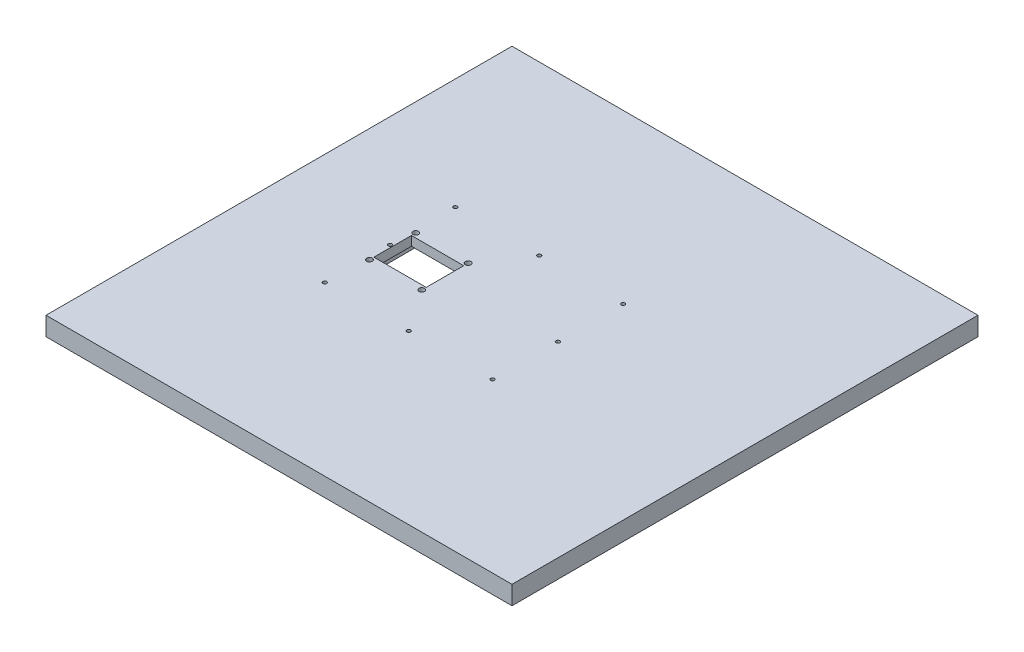
ISO-10303-21;
HEADER;
FILE_DESCRIPTION(('STEP AP214'),'2;1');
FILE_NAME('part.step','',(''),(''),'','','');
FILE_SCHEMA(('AUTOMOTIVE_DESIGN { 1 0 10303 214 1 1 1 1 }'));
ENDSEC;
DATA;
#1=APPLICATION_CONTEXT('core data for automotive mechanical design processes');
#2=APPLICATION_PROTOCOL_DEFINITION('international standard','automotive_design',2000,#1);
#3=PRODUCT_CONTEXT('',#1,'mechanical');
#4=PRODUCT('Part','Part','',(#3));
#5=PRODUCT_RELATED_PRODUCT_CATEGORY('part','',(#4));
#6=PRODUCT_DEFINITION_FORMATION('','',#4);
#7=PRODUCT_DEFINITION_CONTEXT('part definition',#1,'design');
#8=PRODUCT_DEFINITION('design','',#6,#7);
#9=PRODUCT_DEFINITION_SHAPE('','',#8);
#10=(LENGTH_UNIT() NAMED_UNIT(*) SI_UNIT(.MILLI.,.METRE.));
#11=(NAMED_UNIT(*) PLANE_ANGLE_UNIT() SI_UNIT($,.RADIAN.));
#12=(NAMED_UNIT(*) SI_UNIT($,.STERADIAN.) SOLID_ANGLE_UNIT());
#13=UNCERTAINTY_MEASURE_WITH_UNIT(LENGTH_MEASURE(1.E-05),#10,'distance_accuracy_value','');
#14=(GEOMETRIC_REPRESENTATION_CONTEXT(3) GLOBAL_UNCERTAINTY_ASSIGNED_CONTEXT((#13)) GLOBAL_UNIT_ASSIGNED_CONTEXT((#10,
#11,#12)) REPRESENTATION_CONTEXT('',''));
#15=CARTESIAN_POINT('',(0.,0.,0.));
#16=DIRECTION('',(0.,0.,1.));
#17=DIRECTION('',(1.,0.,0.));
#18=AXIS2_PLACEMENT_3D('',#15,#16,#17);
#19=CARTESIAN_POINT('',(-128.072056756494,20.,-24.8638216986086));
#20=DIRECTION('',(0.,-1.,0.));
#21=DIRECTION('',(0.,0.,-1.));
#22=AXIS2_PLACEMENT_3D('',#19,#20,#21);
#23=CYLINDRICAL_SURFACE('',#22,2.99999999999999);
#24=CARTESIAN_POINT('',(-128.072056756494,20.,-24.8638216986086));
#25=DIRECTION('',(0.,1.,0.));
#26=DIRECTION('',(0.,0.,1.));
#27=AXIS2_PLACEMENT_3D('',#24,#25,#26);
#28=CIRCLE('',#27,2.99999999999999);
#29=CARTESIAN_POINT('',(-128.072056756494,20.,-21.8638216986087));
#30=VERTEX_POINT('',#29);
#31=EDGE_CURVE('E216',#30,#30,#28,.T.);
#32=ORIENTED_EDGE('',*,*,#31,.T.);
#33=EDGE_LOOP('',(#32));
#34=FACE_BOUND('',#33,.T.);
#35=CARTESIAN_POINT('',(-128.072056756494,10.,-24.8638216986086));
#36=DIRECTION('',(0.,-1.,0.));
#37=DIRECTION('',(0.,0.,-1.));
#38=AXIS2_PLACEMENT_3D('',#35,#36,#37);
#39=CIRCLE('',#38,2.99999999999999);
#40=CARTESIAN_POINT('',(-128.072056756494,10.,-27.8638216986086));
#41=VERTEX_POINT('',#40);
#42=EDGE_CURVE('E184',#41,#41,#39,.T.);
#43=ORIENTED_EDGE('',*,*,#42,.T.);
#44=EDGE_LOOP('',(#43));
#45=FACE_BOUND('',#44,.T.);
#46=ADVANCED_FACE('F38',(#34,#45),#23,.F.);
#47=CARTESIAN_POINT('',(-71.9279432435065,20.,-24.8638216986087));
#48=DIRECTION('',(0.,-1.,0.));
#49=DIRECTION('',(0.,0.,-1.));
#50=AXIS2_PLACEMENT_3D('',#47,#48,#49);
#51=CYLINDRICAL_SURFACE('',#50,3.00000000000001);
#52=CARTESIAN_POINT('',(-71.9279432435065,20.,-24.8638216986087));
#53=DIRECTION('',(0.,1.,0.));
#54=DIRECTION('',(0.,0.,1.));
#55=AXIS2_PLACEMENT_3D('',#52,#53,#54);
#56=CIRCLE('',#55,3.00000000000001);
#57=CARTESIAN_POINT('',(-71.9279432435065,20.,-21.8638216986087));
#58=VERTEX_POINT('',#57);
#59=EDGE_CURVE('E213',#58,#58,#56,.T.);
#60=ORIENTED_EDGE('',*,*,#59,.T.);
#61=EDGE_LOOP('',(#60));
#62=FACE_BOUND('',#61,.T.);
#63=CARTESIAN_POINT('',(-71.9279432435065,10.,-24.8638216986087));
#64=DIRECTION('',(0.,-1.,0.));
#65=DIRECTION('',(0.,0.,-1.));
#66=AXIS2_PLACEMENT_3D('',#63,#64,#65);
#67=CIRCLE('',#66,3.00000000000001);
#68=CARTESIAN_POINT('',(-71.9279432435065,10.,-27.8638216986087));
#69=VERTEX_POINT('',#68);
#70=EDGE_CURVE('E181',#69,#69,#67,.T.);
#71=ORIENTED_EDGE('',*,*,#70,.T.);
#72=EDGE_LOOP('',(#71));
#73=FACE_BOUND('',#72,.T.);
#74=ADVANCED_FACE('F300',(#62,#73),#51,.F.);
#75=CARTESIAN_POINT('',(-71.9279432435065,20.,24.8638216986087));
#76=DIRECTION('',(0.,-1.,0.));
#77=DIRECTION('',(0.,0.,-1.));
#78=AXIS2_PLACEMENT_3D('',#75,#76,#77);
#79=CYLINDRICAL_SURFACE('',#78,3.00000000000001);
#80=CARTESIAN_POINT('',(-71.9279432435065,20.,24.8638216986087));
#81=DIRECTION('',(0.,1.,0.));
#82=DIRECTION('',(0.,0.,-1.));
#83=AXIS2_PLACEMENT_3D('',#80,#81,#82);
#84=CIRCLE('',#83,3.00000000000001);
#85=CARTESIAN_POINT('',(-71.9279432435065,20.,21.8638216986087));
#86=VERTEX_POINT('',#85);
#87=EDGE_CURVE('E210',#86,#86,#84,.T.);
#88=ORIENTED_EDGE('',*,*,#87,.T.);
#89=EDGE_LOOP('',(#88));
#90=FACE_BOUND('',#89,.T.);
#91=CARTESIAN_POINT('',(-71.9279432435065,10.,24.8638216986087));
#92=DIRECTION('',(0.,-1.,0.));
#93=DIRECTION('',(0.,0.,-1.));
#94=AXIS2_PLACEMENT_3D('',#91,#92,#93);
#95=CIRCLE('',#94,3.00000000000001);
#96=CARTESIAN_POINT('',(-71.9279432435065,10.,21.8638216986087));
#97=VERTEX_POINT('',#96);
#98=EDGE_CURVE('E178',#97,#97,#95,.T.);
#99=ORIENTED_EDGE('',*,*,#98,.T.);
#100=EDGE_LOOP('',(#99));
#101=FACE_BOUND('',#100,.T.);
#102=ADVANCED_FACE('F281',(#90,#101),#79,.F.);
#103=CARTESIAN_POINT('',(-128.072056756494,20.,24.8638216986086));
#104=DIRECTION('',(0.,-1.,0.));
#105=DIRECTION('',(0.,0.,-1.));
#106=AXIS2_PLACEMENT_3D('',#103,#104,#105);
#107=CYLINDRICAL_SURFACE('',#106,2.99999999999999);
#108=CARTESIAN_POINT('',(-128.072056756494,20.,24.8638216986086));
#109=DIRECTION('',(0.,1.,0.));
#110=DIRECTION('',(0.,0.,-1.));
#111=AXIS2_PLACEMENT_3D('',#108,#109,#110);
#112=CIRCLE('',#111,2.99999999999999);
#113=CARTESIAN_POINT('',(-128.072056756494,20.,21.8638216986087));
#114=VERTEX_POINT('',#113);
#115=EDGE_CURVE('E202',#114,#114,#112,.T.);
#116=ORIENTED_EDGE('',*,*,#115,.T.);
#117=EDGE_LOOP('',(#116));
#118=FACE_BOUND('',#117,.T.);
#119=CARTESIAN_POINT('',(-128.072056756494,10.,24.8638216986086));
#120=DIRECTION('',(0.,-1.,0.));
#121=DIRECTION('',(0.,0.,-1.));
#122=AXIS2_PLACEMENT_3D('',#119,#120,#121);
#123=CIRCLE('',#122,2.99999999999999);
#124=CARTESIAN_POINT('',(-128.072056756494,10.,21.8638216986087));
#125=VERTEX_POINT('',#124);
#126=EDGE_CURVE('E175',#125,#125,#123,.T.);
#127=ORIENTED_EDGE('',*,*,#126,.T.);
#128=EDGE_LOOP('',(#127));
#129=FACE_BOUND('',#128,.T.);
#130=ADVANCED_FACE('F277',(#118,#129),#107,.F.);
#131=CARTESIAN_POINT('',(-128.072056756494,0.,0.));
#132=DIRECTION('',(-1.,0.,0.));
#133=DIRECTION('',(0.,0.,1.));
#134=AXIS2_PLACEMENT_3D('',#131,#132,#133);
#135=PLANE('',#134);
#136=DIRECTION('',(0.,0.,1.));
#137=VECTOR('',#136,1.);
#138=CARTESIAN_POINT('',(-128.072056756494,10.,0.));
#139=LINE('',#138,#137);
#140=CARTESIAN_POINT('',(-128.072056756494,10.,-20.1442639638611));
#141=VERTEX_POINT('',#140);
#142=CARTESIAN_POINT('',(-128.072056756494,10.,20.1442639638611));
#143=VERTEX_POINT('',#142);
#144=EDGE_CURVE('E61',#141,#143,#139,.T.);
#145=ORIENTED_EDGE('',*,*,#144,.F.);
#146=DIRECTION('',(0.,1.,0.));
#147=VECTOR('',#146,1.);
#148=CARTESIAN_POINT('',(-128.072056756494,0.,-20.1442639638611));
#149=LINE('',#148,#147);
#150=CARTESIAN_POINT('',(-128.072056756494,20.,-20.1442639638611));
#151=VERTEX_POINT('',#150);
#152=EDGE_CURVE('E200',#141,#151,#149,.T.);
#153=ORIENTED_EDGE('',*,*,#152,.T.);
#154=DIRECTION('',(0.,0.,1.));
#155=VECTOR('',#154,1.);
#156=CARTESIAN_POINT('',(-128.072056756494,20.,0.));
#157=LINE('',#156,#155);
#158=CARTESIAN_POINT('',(-128.072056756494,20.,20.1442639638611));
#159=VERTEX_POINT('',#158);
#160=EDGE_CURVE('E187',#151,#159,#157,.T.);
#161=ORIENTED_EDGE('',*,*,#160,.T.);
#162=DIRECTION('',(0.,1.,0.));
#163=VECTOR('',#162,1.);
#164=CARTESIAN_POINT('',(-128.072056756494,0.,20.1442639638611));
#165=LINE('',#164,#163);
#166=EDGE_CURVE('E199',#143,#159,#165,.T.);
#167=ORIENTED_EDGE('',*,*,#166,.F.);
#168=EDGE_LOOP('',(#145,#153,#161,#167));
#169=FACE_BOUND('',#168,.T.);
#170=ADVANCED_FACE('F280',(#169),#135,.F.);
#171=CARTESIAN_POINT('',(0.,0.,-20.1442639638611));
#172=DIRECTION('',(0.,0.,1.));
#173=DIRECTION('',(1.,0.,0.));
#174=AXIS2_PLACEMENT_3D('',#171,#172,#173);
#175=PLANE('',#174);
#176=ORIENTED_EDGE('',*,*,#152,.F.);
#177=DIRECTION('',(1.,0.,0.));
#178=VECTOR('',#177,1.);
#179=CARTESIAN_POINT('',(0.,10.,-20.1442639638611));
#180=LINE('',#179,#178);
#181=CARTESIAN_POINT('',(-71.9279432435065,10.,-20.1442639638611));
#182=VERTEX_POINT('',#181);
#183=EDGE_CURVE('E171',#141,#182,#180,.T.);
#184=ORIENTED_EDGE('',*,*,#183,.T.);
#185=DIRECTION('',(0.,1.,0.));
#186=VECTOR('',#185,1.);
#187=CARTESIAN_POINT('',(-71.9279432435065,0.,-20.1442639638611));
#188=LINE('',#187,#186);
#189=CARTESIAN_POINT('',(-71.9279432435065,20.,-20.1442639638611));
#190=VERTEX_POINT('',#189);
#191=EDGE_CURVE('E203',#182,#190,#188,.T.);
#192=ORIENTED_EDGE('',*,*,#191,.T.);
#193=DIRECTION('',(1.,0.,0.));
#194=VECTOR('',#193,1.);
#195=CARTESIAN_POINT('',(0.,20.,-20.1442639638611));
#196=LINE('',#195,#194);
#197=EDGE_CURVE('E196',#151,#190,#196,.T.);
#198=ORIENTED_EDGE('',*,*,#197,.F.);
#199=EDGE_LOOP('',(#176,#184,#192,#198));
#200=FACE_BOUND('',#199,.T.);
#201=ADVANCED_FACE('F345',(#200),#175,.T.);
#202=CARTESIAN_POINT('',(-71.9279432435065,0.,0.));
#203=DIRECTION('',(-1.,0.,0.));
#204=DIRECTION('',(0.,0.,1.));
#205=AXIS2_PLACEMENT_3D('',#202,#203,#204);
#206=PLANE('',#205);
#207=ORIENTED_EDGE('',*,*,#191,.F.);
#208=DIRECTION('',(0.,0.,1.));
#209=VECTOR('',#208,1.);
#210=CARTESIAN_POINT('',(-71.9279432435065,10.,0.));
#211=LINE('',#210,#209);
#212=CARTESIAN_POINT('',(-71.9279432435065,10.,20.1442639638611));
#213=VERTEX_POINT('',#212);
#214=EDGE_CURVE('E165',#182,#213,#211,.T.);
#215=ORIENTED_EDGE('',*,*,#214,.T.);
#216=DIRECTION('',(0.,1.,0.));
#217=VECTOR('',#216,1.);
#218=CARTESIAN_POINT('',(-71.9279432435065,0.,20.1442639638611));
#219=LINE('',#218,#217);
#220=CARTESIAN_POINT('',(-71.9279432435065,20.,20.1442639638611));
#221=VERTEX_POINT('',#220);
#222=EDGE_CURVE('E205',#213,#221,#219,.T.);
#223=ORIENTED_EDGE('',*,*,#222,.T.);
#224=DIRECTION('',(0.,0.,1.));
#225=VECTOR('',#224,1.);
#226=CARTESIAN_POINT('',(-71.9279432435065,20.,0.));
#227=LINE('',#226,#225);
#228=EDGE_CURVE('E193',#190,#221,#227,.T.);
#229=ORIENTED_EDGE('',*,*,#228,.F.);
#230=EDGE_LOOP('',(#207,#215,#223,#229));
#231=FACE_BOUND('',#230,.T.);
#232=ADVANCED_FACE('F336',(#231),#206,.T.);
#233=CARTESIAN_POINT('',(0.,0.,20.1442639638611));
#234=DIRECTION('',(0.,0.,1.));
#235=DIRECTION('',(1.,0.,0.));
#236=AXIS2_PLACEMENT_3D('',#233,#234,#235);
#237=PLANE('',#236);
#238=DIRECTION('',(1.,0.,0.));
#239=VECTOR('',#238,1.);
#240=CARTESIAN_POINT('',(0.,10.,20.1442639638611));
#241=LINE('',#240,#239);
#242=EDGE_CURVE('E11',#143,#213,#241,.T.);
#243=ORIENTED_EDGE('',*,*,#242,.F.);
#244=ORIENTED_EDGE('',*,*,#166,.T.);
#245=DIRECTION('',(1.,0.,0.));
#246=VECTOR('',#245,1.);
#247=CARTESIAN_POINT('',(0.,20.,20.1442639638611));
#248=LINE('',#247,#246);
#249=EDGE_CURVE('E190',#159,#221,#248,.T.);
#250=ORIENTED_EDGE('',*,*,#249,.T.);
#251=ORIENTED_EDGE('',*,*,#222,.F.);
#252=EDGE_LOOP('',(#243,#244,#250,#251));
#253=FACE_BOUND('',#252,.T.);
#254=ADVANCED_FACE('F270',(#253),#237,.F.);
#255=CARTESIAN_POINT('',(0.,20.,0.));
#256=DIRECTION('',(0.,1.,0.));
#257=DIRECTION('',(0.,0.,1.));
#258=AXIS2_PLACEMENT_3D('',#255,#256,#257);
#259=PLANE('',#258);
#260=CARTESIAN_POINT('',(49.1854308594758,20.,-70.));
#261=DIRECTION('',(0.,1.,0.));
#262=DIRECTION('',(0.,0.,-1.));
#263=AXIS2_PLACEMENT_3D('',#260,#261,#262);
#264=CIRCLE('',#263,2.);
#265=CARTESIAN_POINT('',(49.1854308594758,20.,-72.));
#266=VERTEX_POINT('',#265);
#267=EDGE_CURVE('E536',#266,#266,#264,.T.);
#268=ORIENTED_EDGE('',*,*,#267,.F.);
#269=EDGE_LOOP('',(#268));
#270=FACE_BOUND('',#269,.T.);
#271=CARTESIAN_POINT('',(-40.8145691405242,20.,-70.));
#272=DIRECTION('',(0.,1.,0.));
#273=DIRECTION('',(0.,0.,1.));
#274=AXIS2_PLACEMENT_3D('',#271,#272,#273);
#275=CIRCLE('',#274,2.);
#276=CARTESIAN_POINT('',(-40.8145691405242,20.,-68.));
#277=VERTEX_POINT('',#276);
#278=EDGE_CURVE('E541',#277,#277,#275,.T.);
#279=ORIENTED_EDGE('',*,*,#278,.F.);
#280=EDGE_LOOP('',(#279));
#281=FACE_BOUND('',#280,.T.);
#282=CARTESIAN_POINT('',(-130.814569140524,20.,70.));
#283=DIRECTION('',(0.,1.,0.));
#284=DIRECTION('',(0.,0.,-1.));
#285=AXIS2_PLACEMENT_3D('',#282,#283,#284);
#286=CIRCLE('',#285,2.);
#287=CARTESIAN_POINT('',(-130.814569140524,20.,68.));
#288=VERTEX_POINT('',#287);
#289=EDGE_CURVE('E550',#288,#288,#286,.T.);
#290=ORIENTED_EDGE('',*,*,#289,.F.);
#291=EDGE_LOOP('',(#290));
#292=FACE_BOUND('',#291,.T.);
#293=CARTESIAN_POINT('',(-40.8145691405242,20.,70.));
#294=DIRECTION('',(0.,1.,0.));
#295=DIRECTION('',(0.,0.,-1.));
#296=AXIS2_PLACEMENT_3D('',#293,#294,#295);
#297=CIRCLE('',#296,2.);
#298=CARTESIAN_POINT('',(-40.8145691405242,20.,68.));
#299=VERTEX_POINT('',#298);
#300=EDGE_CURVE('E556',#299,#299,#297,.T.);
#301=ORIENTED_EDGE('',*,*,#300,.F.);
#302=EDGE_LOOP('',(#301));
#303=FACE_BOUND('',#302,.T.);
#304=CARTESIAN_POINT('',(49.1854308594758,20.,70.));
#305=DIRECTION('',(0.,1.,0.));
#306=DIRECTION('',(0.,0.,1.));
#307=AXIS2_PLACEMENT_3D('',#304,#305,#306);
#308=CIRCLE('',#307,2.);
#309=CARTESIAN_POINT('',(49.1854308594758,20.,72.));
#310=VERTEX_POINT('',#309);
#311=EDGE_CURVE('E596',#310,#310,#308,.T.);
#312=ORIENTED_EDGE('',*,*,#311,.F.);
#313=EDGE_LOOP('',(#312));
#314=FACE_BOUND('',#313,.T.);
#315=CARTESIAN_POINT('',(49.1854308594758,20.,0.));
#316=DIRECTION('',(0.,1.,0.));
#317=DIRECTION('',(0.,0.,1.));
#318=AXIS2_PLACEMENT_3D('',#315,#316,#317);
#319=CIRCLE('',#318,2.);
#320=CARTESIAN_POINT('',(49.1854308594758,20.,2.));
#321=VERTEX_POINT('',#320);
#322=EDGE_CURVE('E589',#321,#321,#319,.T.);
#323=ORIENTED_EDGE('',*,*,#322,.F.);
#324=EDGE_LOOP('',(#323));
#325=FACE_BOUND('',#324,.T.);
#326=CARTESIAN_POINT('',(-130.814569140524,20.,0.));
#327=DIRECTION('',(0.,1.,0.));
#328=DIRECTION('',(0.,0.,-1.));
#329=AXIS2_PLACEMENT_3D('',#326,#327,#328);
#330=CIRCLE('',#329,2.00000000000002);
#331=CARTESIAN_POINT('',(-130.814569140524,20.,-1.99999999999999));
#332=VERTEX_POINT('',#331);
#333=EDGE_CURVE('E587',#332,#332,#330,.T.);
#334=ORIENTED_EDGE('',*,*,#333,.F.);
#335=EDGE_LOOP('',(#334));
#336=FACE_BOUND('',#335,.T.);
#337=CARTESIAN_POINT('',(-130.814569140524,20.,-70.));
#338=DIRECTION('',(0.,1.,0.));
#339=DIRECTION('',(0.,0.,1.));
#340=AXIS2_PLACEMENT_3D('',#337,#338,#339);
#341=CIRCLE('',#340,2.);
#342=CARTESIAN_POINT('',(-130.814569140524,20.,-68.));
#343=VERTEX_POINT('',#342);
#344=EDGE_CURVE('E153',#343,#343,#341,.T.);
#345=ORIENTED_EDGE('',*,*,#344,.F.);
#346=EDGE_LOOP('',(#345));
#347=FACE_BOUND('',#346,.T.);
#348=ORIENTED_EDGE('',*,*,#160,.F.);
#349=ORIENTED_EDGE('',*,*,#197,.T.);
#350=ORIENTED_EDGE('',*,*,#228,.T.);
#351=ORIENTED_EDGE('',*,*,#249,.F.);
#352=EDGE_LOOP('',(#348,#349,#350,#351));
#353=FACE_BOUND('',#352,.T.);
#354=ORIENTED_EDGE('',*,*,#87,.F.);
#355=EDGE_LOOP('',(#354));
#356=FACE_BOUND('',#355,.T.);
#357=ORIENTED_EDGE('',*,*,#31,.F.);
#358=EDGE_LOOP('',(#357));
#359=FACE_BOUND('',#358,.T.);
#360=DIRECTION('',(0.,0.,-1.));
#361=VECTOR('',#360,1.);
#362=CARTESIAN_POINT('',(250.,20.,-250.));
#363=LINE('',#362,#361);
#364=CARTESIAN_POINT('',(250.,20.,250.));
#365=VERTEX_POINT('',#364);
#366=CARTESIAN_POINT('',(250.,20.,-250.));
#367=VERTEX_POINT('',#366);
#368=EDGE_CURVE('E220',#365,#367,#363,.T.);
#369=ORIENTED_EDGE('',*,*,#368,.T.);
#370=DIRECTION('',(-1.,0.,0.));
#371=VECTOR('',#370,1.);
#372=CARTESIAN_POINT('',(-250.,20.,-250.));
#373=LINE('',#372,#371);
#374=CARTESIAN_POINT('',(-250.,20.,-250.));
#375=VERTEX_POINT('',#374);
#376=EDGE_CURVE('E223',#367,#375,#373,.T.);
#377=ORIENTED_EDGE('',*,*,#376,.T.);
#378=DIRECTION('',(0.,0.,1.));
#379=VECTOR('',#378,1.);
#380=CARTESIAN_POINT('',(-250.,20.,-250.));
#381=LINE('',#380,#379);
#382=CARTESIAN_POINT('',(-250.,20.,250.));
#383=VERTEX_POINT('',#382);
#384=EDGE_CURVE('E226',#375,#383,#381,.T.);
#385=ORIENTED_EDGE('',*,*,#384,.T.);
#386=DIRECTION('',(1.,0.,0.));
#387=VECTOR('',#386,1.);
#388=CARTESIAN_POINT('',(-250.,20.,250.));
#389=LINE('',#388,#387);
#390=EDGE_CURVE('E228',#383,#365,#389,.T.);
#391=ORIENTED_EDGE('',*,*,#390,.T.);
#392=EDGE_LOOP('',(#369,#377,#385,#391));
#393=FACE_BOUND('',#392,.T.);
#394=ORIENTED_EDGE('',*,*,#59,.F.);
#395=EDGE_LOOP('',(#394));
#396=FACE_BOUND('',#395,.T.);
#397=ORIENTED_EDGE('',*,*,#115,.F.);
#398=EDGE_LOOP('',(#397));
#399=FACE_BOUND('',#398,.T.);
#400=ADVANCED_FACE('F267',(#270,#281,#292,#303,#314,#325,#336,#347,#353,#356,#359,#393,#396,
#399),#259,.T.);
#401=CARTESIAN_POINT('',(0.,0.,0.));
#402=DIRECTION('',(0.,1.,0.));
#403=DIRECTION('',(0.,0.,1.));
#404=AXIS2_PLACEMENT_3D('',#401,#402,#403);
#405=PLANE('',#404);
#406=CARTESIAN_POINT('',(49.1854308594758,0.,-70.));
#407=DIRECTION('',(0.,1.,0.));
#408=DIRECTION('',(0.,0.,-1.));
#409=AXIS2_PLACEMENT_3D('',#406,#407,#408);
#410=CIRCLE('',#409,2.);
#411=CARTESIAN_POINT('',(49.1854308594758,0.,-72.));
#412=VERTEX_POINT('',#411);
#413=EDGE_CURVE('E533',#412,#412,#410,.T.);
#414=ORIENTED_EDGE('',*,*,#413,.T.);
#415=EDGE_LOOP('',(#414));
#416=FACE_BOUND('',#415,.T.);
#417=CARTESIAN_POINT('',(-40.8145691405242,0.,-70.));
#418=DIRECTION('',(0.,1.,0.));
#419=DIRECTION('',(0.,0.,1.));
#420=AXIS2_PLACEMENT_3D('',#417,#418,#419);
#421=CIRCLE('',#420,2.);
#422=CARTESIAN_POINT('',(-40.8145691405242,0.,-68.));
#423=VERTEX_POINT('',#422);
#424=EDGE_CURVE('E537',#423,#423,#421,.T.);
#425=ORIENTED_EDGE('',*,*,#424,.T.);
#426=EDGE_LOOP('',(#425));
#427=FACE_BOUND('',#426,.T.);
#428=CARTESIAN_POINT('',(-130.814569140524,0.,70.));
#429=DIRECTION('',(0.,1.,0.));
#430=DIRECTION('',(0.,0.,-1.));
#431=AXIS2_PLACEMENT_3D('',#428,#429,#430);
#432=CIRCLE('',#431,2.);
#433=CARTESIAN_POINT('',(-130.814569140524,0.,68.));
#434=VERTEX_POINT('',#433);
#435=EDGE_CURVE('E547',#434,#434,#432,.T.);
#436=ORIENTED_EDGE('',*,*,#435,.T.);
#437=EDGE_LOOP('',(#436));
#438=FACE_BOUND('',#437,.T.);
#439=CARTESIAN_POINT('',(-40.8145691405242,0.,70.));
#440=DIRECTION('',(0.,1.,0.));
#441=DIRECTION('',(0.,0.,-1.));
#442=AXIS2_PLACEMENT_3D('',#439,#440,#441);
#443=CIRCLE('',#442,2.);
#444=CARTESIAN_POINT('',(-40.8145691405242,0.,68.));
#445=VERTEX_POINT('',#444);
#446=EDGE_CURVE('E553',#445,#445,#443,.T.);
#447=ORIENTED_EDGE('',*,*,#446,.T.);
#448=EDGE_LOOP('',(#447));
#449=FACE_BOUND('',#448,.T.);
#450=CARTESIAN_POINT('',(49.1854308594758,0.,70.));
#451=DIRECTION('',(0.,1.,0.));
#452=DIRECTION('',(0.,0.,1.));
#453=AXIS2_PLACEMENT_3D('',#450,#451,#452);
#454=CIRCLE('',#453,2.);
#455=CARTESIAN_POINT('',(49.1854308594758,0.,72.));
#456=VERTEX_POINT('',#455);
#457=EDGE_CURVE('E558',#456,#456,#454,.T.);
#458=ORIENTED_EDGE('',*,*,#457,.T.);
#459=EDGE_LOOP('',(#458));
#460=FACE_BOUND('',#459,.T.);
#461=CARTESIAN_POINT('',(49.1854308594758,0.,0.));
#462=DIRECTION('',(0.,1.,0.));
#463=DIRECTION('',(0.,0.,1.));
#464=AXIS2_PLACEMENT_3D('',#461,#462,#463);
#465=CIRCLE('',#464,2.);
#466=CARTESIAN_POINT('',(49.1854308594758,0.,2.));
#467=VERTEX_POINT('',#466);
#468=EDGE_CURVE('E591',#467,#467,#465,.T.);
#469=ORIENTED_EDGE('',*,*,#468,.T.);
#470=EDGE_LOOP('',(#469));
#471=FACE_BOUND('',#470,.T.);
#472=CARTESIAN_POINT('',(-130.814569140524,0.,-70.));
#473=DIRECTION('',(0.,1.,0.));
#474=DIRECTION('',(0.,0.,1.));
#475=AXIS2_PLACEMENT_3D('',#472,#473,#474);
#476=CIRCLE('',#475,2.);
#477=CARTESIAN_POINT('',(-130.814569140524,0.,-68.));
#478=VERTEX_POINT('',#477);
#479=EDGE_CURVE('E559',#478,#478,#476,.T.);
#480=ORIENTED_EDGE('',*,*,#479,.T.);
#481=EDGE_LOOP('',(#480));
#482=FACE_BOUND('',#481,.T.);
#483=DIRECTION('',(1.,0.,0.));
#484=VECTOR('',#483,1.);
#485=CARTESIAN_POINT('',(-65.3950758444858,0.,-33.7795925762031));
#486=LINE('',#485,#484);
#487=CARTESIAN_POINT('',(-134.604924155515,0.,-33.7795925762031));
#488=VERTEX_POINT('',#487);
#489=CARTESIAN_POINT('',(-65.3950758444858,0.,-33.7795925762031));
#490=VERTEX_POINT('',#489);
#491=EDGE_CURVE('E159',#488,#490,#486,.T.);
#492=ORIENTED_EDGE('',*,*,#491,.F.);
#493=DIRECTION('',(0.,0.,-1.));
#494=VECTOR('',#493,1.);
#495=CARTESIAN_POINT('',(-134.604924155515,0.,-33.7795925762031));
#496=LINE('',#495,#494);
#497=CARTESIAN_POINT('',(-134.604924155515,0.,33.779592576203));
#498=VERTEX_POINT('',#497);
#499=EDGE_CURVE('E54',#498,#488,#496,.T.);
#500=ORIENTED_EDGE('',*,*,#499,.F.);
#501=DIRECTION('',(-1.,0.,0.));
#502=VECTOR('',#501,1.);
#503=CARTESIAN_POINT('',(-65.3950758444858,0.,33.779592576203));
#504=LINE('',#503,#502);
#505=CARTESIAN_POINT('',(-65.3950758444858,0.,33.779592576203));
#506=VERTEX_POINT('',#505);
#507=EDGE_CURVE('E147',#506,#498,#504,.T.);
#508=ORIENTED_EDGE('',*,*,#507,.F.);
#509=DIRECTION('',(0.,0.,1.));
#510=VECTOR('',#509,1.);
#511=CARTESIAN_POINT('',(-65.3950758444858,0.,-33.7795925762031));
#512=LINE('',#511,#510);
#513=EDGE_CURVE('E150',#490,#506,#512,.T.);
#514=ORIENTED_EDGE('',*,*,#513,.F.);
#515=EDGE_LOOP('',(#492,#500,#508,#514));
#516=FACE_BOUND('',#515,.T.);
#517=DIRECTION('',(0.,0.,-1.));
#518=VECTOR('',#517,1.);
#519=CARTESIAN_POINT('',(250.,0.,-250.));
#520=LINE('',#519,#518);
#521=CARTESIAN_POINT('',(250.,0.,250.));
#522=VERTEX_POINT('',#521);
#523=CARTESIAN_POINT('',(250.,0.,-250.));
#524=VERTEX_POINT('',#523);
#525=EDGE_CURVE('E219',#522,#524,#520,.T.);
#526=ORIENTED_EDGE('',*,*,#525,.F.);
#527=DIRECTION('',(1.,0.,0.));
#528=VECTOR('',#527,1.);
#529=CARTESIAN_POINT('',(-250.,0.,250.));
#530=LINE('',#529,#528);
#531=CARTESIAN_POINT('',(-250.,0.,250.));
#532=VERTEX_POINT('',#531);
#533=EDGE_CURVE('E224',#532,#522,#530,.T.);
#534=ORIENTED_EDGE('',*,*,#533,.F.);
#535=DIRECTION('',(0.,0.,1.));
#536=VECTOR('',#535,1.);
#537=CARTESIAN_POINT('',(-250.,0.,-250.));
#538=LINE('',#537,#536);
#539=CARTESIAN_POINT('',(-250.,0.,-250.));
#540=VERTEX_POINT('',#539);
#541=EDGE_CURVE('E235',#540,#532,#538,.T.);
#542=ORIENTED_EDGE('',*,*,#541,.F.);
#543=DIRECTION('',(-1.,0.,0.));
#544=VECTOR('',#543,1.);
#545=CARTESIAN_POINT('',(-250.,0.,-250.));
#546=LINE('',#545,#544);
#547=EDGE_CURVE('E233',#524,#540,#546,.T.);
#548=ORIENTED_EDGE('',*,*,#547,.F.);
#549=EDGE_LOOP('',(#526,#534,#542,#548));
#550=FACE_BOUND('',#549,.T.);
#551=ADVANCED_FACE('F257',(#416,#427,#438,#449,#460,#471,#482,#516,#550),#405,.F.);
#552=CARTESIAN_POINT('',(250.,20.,-250.));
#553=DIRECTION('',(-1.,0.,0.));
#554=DIRECTION('',(0.,0.,1.));
#555=AXIS2_PLACEMENT_3D('',#552,#553,#554);
#556=PLANE('',#555);
#557=ORIENTED_EDGE('',*,*,#525,.T.);
#558=DIRECTION('',(0.,-1.,0.));
#559=VECTOR('',#558,1.);
#560=CARTESIAN_POINT('',(250.,20.,-250.));
#561=LINE('',#560,#559);
#562=EDGE_CURVE('E47',#367,#524,#561,.T.);
#563=ORIENTED_EDGE('',*,*,#562,.F.);
#564=ORIENTED_EDGE('',*,*,#368,.F.);
#565=DIRECTION('',(0.,-1.,0.));
#566=VECTOR('',#565,1.);
#567=CARTESIAN_POINT('',(250.,20.,250.));
#568=LINE('',#567,#566);
#569=EDGE_CURVE('E230',#365,#522,#568,.T.);
#570=ORIENTED_EDGE('',*,*,#569,.T.);
#571=EDGE_LOOP('',(#557,#563,#564,#570));
#572=FACE_BOUND('',#571,.T.);
#573=ADVANCED_FACE('F40',(#572),#556,.F.);
#574=CARTESIAN_POINT('',(-250.,20.,-250.));
#575=DIRECTION('',(0.,0.,1.));
#576=DIRECTION('',(1.,0.,0.));
#577=AXIS2_PLACEMENT_3D('',#574,#575,#576);
#578=PLANE('',#577);
#579=ORIENTED_EDGE('',*,*,#547,.T.);
#580=DIRECTION('',(0.,-1.,0.));
#581=VECTOR('',#580,1.);
#582=CARTESIAN_POINT('',(-250.,20.,-250.));
#583=LINE('',#582,#581);
#584=EDGE_CURVE('E243',#375,#540,#583,.T.);
#585=ORIENTED_EDGE('',*,*,#584,.F.);
#586=ORIENTED_EDGE('',*,*,#376,.F.);
#587=ORIENTED_EDGE('',*,*,#562,.T.);
#588=EDGE_LOOP('',(#579,#585,#586,#587));
#589=FACE_BOUND('',#588,.T.);
#590=ADVANCED_FACE('F249',(#589),#578,.F.);
#591=CARTESIAN_POINT('',(-250.,20.,-250.));
#592=DIRECTION('',(1.,0.,0.));
#593=DIRECTION('',(0.,0.,-1.));
#594=AXIS2_PLACEMENT_3D('',#591,#592,#593);
#595=PLANE('',#594);
#596=ORIENTED_EDGE('',*,*,#541,.T.);
#597=DIRECTION('',(0.,-1.,0.));
#598=VECTOR('',#597,1.);
#599=CARTESIAN_POINT('',(-250.,20.,250.));
#600=LINE('',#599,#598);
#601=EDGE_CURVE('E240',#383,#532,#600,.T.);
#602=ORIENTED_EDGE('',*,*,#601,.F.);
#603=ORIENTED_EDGE('',*,*,#384,.F.);
#604=ORIENTED_EDGE('',*,*,#584,.T.);
#605=EDGE_LOOP('',(#596,#602,#603,#604));
#606=FACE_BOUND('',#605,.T.);
#607=ADVANCED_FACE('F261',(#606),#595,.F.);
#608=CARTESIAN_POINT('',(-250.,20.,250.));
#609=DIRECTION('',(0.,0.,-1.));
#610=DIRECTION('',(-1.,0.,0.));
#611=AXIS2_PLACEMENT_3D('',#608,#609,#610);
#612=PLANE('',#611);
#613=ORIENTED_EDGE('',*,*,#533,.T.);
#614=ORIENTED_EDGE('',*,*,#569,.F.);
#615=ORIENTED_EDGE('',*,*,#390,.F.);
#616=ORIENTED_EDGE('',*,*,#601,.T.);
#617=EDGE_LOOP('',(#613,#614,#615,#616));
#618=FACE_BOUND('',#617,.T.);
#619=ADVANCED_FACE('F265',(#618),#612,.F.);
#620=CARTESIAN_POINT('',(0.,10.,0.));
#621=DIRECTION('',(0.,-1.,0.));
#622=DIRECTION('',(0.,0.,-1.));
#623=AXIS2_PLACEMENT_3D('',#620,#621,#622);
#624=PLANE('',#623);
#625=CARTESIAN_POINT('',(-130.814569140524,10.,0.));
#626=DIRECTION('',(0.,-1.,0.));
#627=DIRECTION('',(0.,0.,-1.));
#628=AXIS2_PLACEMENT_3D('',#625,#626,#627);
#629=CIRCLE('',#628,2.00000000000002);
#630=CARTESIAN_POINT('',(-130.814569140524,10.,-1.99999999999999));
#631=VERTEX_POINT('',#630);
#632=EDGE_CURVE('E42',#631,#631,#629,.T.);
#633=ORIENTED_EDGE('',*,*,#632,.F.);
#634=EDGE_LOOP('',(#633));
#635=FACE_BOUND('',#634,.T.);
#636=ORIENTED_EDGE('',*,*,#42,.F.);
#637=EDGE_LOOP('',(#636));
#638=FACE_BOUND('',#637,.T.);
#639=ORIENTED_EDGE('',*,*,#70,.F.);
#640=EDGE_LOOP('',(#639));
#641=FACE_BOUND('',#640,.T.);
#642=ORIENTED_EDGE('',*,*,#98,.F.);
#643=EDGE_LOOP('',(#642));
#644=FACE_BOUND('',#643,.T.);
#645=ORIENTED_EDGE('',*,*,#126,.F.);
#646=EDGE_LOOP('',(#645));
#647=FACE_BOUND('',#646,.T.);
#648=DIRECTION('',(0.,0.,-1.));
#649=VECTOR('',#648,1.);
#650=CARTESIAN_POINT('',(-134.604924155515,10.,-33.7795925762031));
#651=LINE('',#650,#649);
#652=CARTESIAN_POINT('',(-134.604924155515,10.,33.779592576203));
#653=VERTEX_POINT('',#652);
#654=CARTESIAN_POINT('',(-134.604924155515,10.,-33.7795925762031));
#655=VERTEX_POINT('',#654);
#656=EDGE_CURVE('E129',#653,#655,#651,.T.);
#657=ORIENTED_EDGE('',*,*,#656,.T.);
#658=DIRECTION('',(1.,0.,0.));
#659=VECTOR('',#658,1.);
#660=CARTESIAN_POINT('',(-65.3950758444858,10.,-33.7795925762031));
#661=LINE('',#660,#659);
#662=CARTESIAN_POINT('',(-65.3950758444858,10.,-33.7795925762031));
#663=VERTEX_POINT('',#662);
#664=EDGE_CURVE('E138',#655,#663,#661,.T.);
#665=ORIENTED_EDGE('',*,*,#664,.T.);
#666=DIRECTION('',(0.,0.,1.));
#667=VECTOR('',#666,1.);
#668=CARTESIAN_POINT('',(-65.3950758444858,10.,-33.7795925762031));
#669=LINE('',#668,#667);
#670=CARTESIAN_POINT('',(-65.3950758444858,10.,33.779592576203));
#671=VERTEX_POINT('',#670);
#672=EDGE_CURVE('E143',#663,#671,#669,.T.);
#673=ORIENTED_EDGE('',*,*,#672,.T.);
#674=DIRECTION('',(-1.,0.,0.));
#675=VECTOR('',#674,1.);
#676=CARTESIAN_POINT('',(-65.3950758444858,10.,33.779592576203));
#677=LINE('',#676,#675);
#678=EDGE_CURVE('E135',#671,#653,#677,.T.);
#679=ORIENTED_EDGE('',*,*,#678,.T.);
#680=EDGE_LOOP('',(#657,#665,#673,#679));
#681=FACE_BOUND('',#680,.T.);
#682=ORIENTED_EDGE('',*,*,#144,.T.);
#683=ORIENTED_EDGE('',*,*,#242,.T.);
#684=ORIENTED_EDGE('',*,*,#214,.F.);
#685=ORIENTED_EDGE('',*,*,#183,.F.);
#686=EDGE_LOOP('',(#682,#683,#684,#685));
#687=FACE_BOUND('',#686,.T.);
#688=ADVANCED_FACE('F145',(#635,#638,#641,#644,#647,#681,#687),#624,.T.);
#689=CARTESIAN_POINT('',(-134.604924155515,10.,-33.7795925762031));
#690=DIRECTION('',(-1.,0.,0.));
#691=DIRECTION('',(0.,0.,1.));
#692=AXIS2_PLACEMENT_3D('',#689,#690,#691);
#693=PLANE('',#692);
#694=ORIENTED_EDGE('',*,*,#499,.T.);
#695=DIRECTION('',(0.,-1.,0.));
#696=VECTOR('',#695,1.);
#697=CARTESIAN_POINT('',(-134.604924155515,10.,-33.7795925762031));
#698=LINE('',#697,#696);
#699=EDGE_CURVE('E125',#655,#488,#698,.T.);
#700=ORIENTED_EDGE('',*,*,#699,.F.);
#701=ORIENTED_EDGE('',*,*,#656,.F.);
#702=DIRECTION('',(0.,-1.,0.));
#703=VECTOR('',#702,1.);
#704=CARTESIAN_POINT('',(-134.604924155515,10.,33.779592576203));
#705=LINE('',#704,#703);
#706=EDGE_CURVE('E163',#653,#498,#705,.T.);
#707=ORIENTED_EDGE('',*,*,#706,.T.);
#708=EDGE_LOOP('',(#694,#700,#701,#707));
#709=FACE_BOUND('',#708,.T.);
#710=ADVANCED_FACE('F127',(#709),#693,.F.);
#711=CARTESIAN_POINT('',(-65.3950758444858,10.,33.779592576203));
#712=DIRECTION('',(0.,0.,1.));
#713=DIRECTION('',(1.,0.,0.));
#714=AXIS2_PLACEMENT_3D('',#711,#712,#713);
#715=PLANE('',#714);
#716=ORIENTED_EDGE('',*,*,#507,.T.);
#717=ORIENTED_EDGE('',*,*,#706,.F.);
#718=ORIENTED_EDGE('',*,*,#678,.F.);
#719=DIRECTION('',(0.,-1.,0.));
#720=VECTOR('',#719,1.);
#721=CARTESIAN_POINT('',(-65.3950758444858,10.,33.779592576203));
#722=LINE('',#721,#720);
#723=EDGE_CURVE('E166',#671,#506,#722,.T.);
#724=ORIENTED_EDGE('',*,*,#723,.T.);
#725=EDGE_LOOP('',(#716,#717,#718,#724));
#726=FACE_BOUND('',#725,.T.);
#727=ADVANCED_FACE('F292',(#726),#715,.F.);
#728=CARTESIAN_POINT('',(-65.3950758444858,10.,-33.7795925762031));
#729=DIRECTION('',(1.,0.,0.));
#730=DIRECTION('',(0.,0.,-1.));
#731=AXIS2_PLACEMENT_3D('',#728,#729,#730);
#732=PLANE('',#731);
#733=ORIENTED_EDGE('',*,*,#513,.T.);
#734=ORIENTED_EDGE('',*,*,#723,.F.);
#735=ORIENTED_EDGE('',*,*,#672,.F.);
#736=DIRECTION('',(0.,-1.,0.));
#737=VECTOR('',#736,1.);
#738=CARTESIAN_POINT('',(-65.3950758444858,10.,-33.7795925762031));
#739=LINE('',#738,#737);
#740=EDGE_CURVE('E134',#663,#490,#739,.T.);
#741=ORIENTED_EDGE('',*,*,#740,.T.);
#742=EDGE_LOOP('',(#733,#734,#735,#741));
#743=FACE_BOUND('',#742,.T.);
#744=ADVANCED_FACE('F432',(#743),#732,.F.);
#745=CARTESIAN_POINT('',(-65.3950758444858,10.,-33.7795925762031));
#746=DIRECTION('',(0.,0.,-1.));
#747=DIRECTION('',(-1.,0.,0.));
#748=AXIS2_PLACEMENT_3D('',#745,#746,#747);
#749=PLANE('',#748);
#750=ORIENTED_EDGE('',*,*,#491,.T.);
#751=ORIENTED_EDGE('',*,*,#740,.F.);
#752=ORIENTED_EDGE('',*,*,#664,.F.);
#753=ORIENTED_EDGE('',*,*,#699,.T.);
#754=EDGE_LOOP('',(#750,#751,#752,#753));
#755=FACE_BOUND('',#754,.T.);
#756=ADVANCED_FACE('F139',(#755),#749,.F.);
#757=CARTESIAN_POINT('',(-130.814569140524,0.,0.));
#758=DIRECTION('',(0.,1.,0.));
#759=DIRECTION('',(0.,0.,1.));
#760=AXIS2_PLACEMENT_3D('',#757,#758,#759);
#761=CYLINDRICAL_SURFACE('',#760,2.00000000000002);
#762=ORIENTED_EDGE('',*,*,#632,.T.);
#763=EDGE_LOOP('',(#762));
#764=FACE_BOUND('',#763,.T.);
#765=ORIENTED_EDGE('',*,*,#333,.T.);
#766=EDGE_LOOP('',(#765));
#767=FACE_BOUND('',#766,.T.);
#768=ADVANCED_FACE('F447',(#764,#767),#761,.F.);
#769=CARTESIAN_POINT('',(-130.814569140524,0.,-70.));
#770=DIRECTION('',(0.,1.,0.));
#771=DIRECTION('',(0.,0.,1.));
#772=AXIS2_PLACEMENT_3D('',#769,#770,#771);
#773=CYLINDRICAL_SURFACE('',#772,2.);
#774=ORIENTED_EDGE('',*,*,#479,.F.);
#775=EDGE_LOOP('',(#774));
#776=FACE_BOUND('',#775,.T.);
#777=ORIENTED_EDGE('',*,*,#344,.T.);
#778=EDGE_LOOP('',(#777));
#779=FACE_BOUND('',#778,.T.);
#780=ADVANCED_FACE('F454',(#776,#779),#773,.F.);
#781=CARTESIAN_POINT('',(49.1854308594758,0.,0.));
#782=DIRECTION('',(0.,1.,0.));
#783=DIRECTION('',(0.,0.,1.));
#784=AXIS2_PLACEMENT_3D('',#781,#782,#783);
#785=CYLINDRICAL_SURFACE('',#784,2.);
#786=ORIENTED_EDGE('',*,*,#468,.F.);
#787=EDGE_LOOP('',(#786));
#788=FACE_BOUND('',#787,.T.);
#789=ORIENTED_EDGE('',*,*,#322,.T.);
#790=EDGE_LOOP('',(#789));
#791=FACE_BOUND('',#790,.T.);
#792=ADVANCED_FACE('F463',(#788,#791),#785,.F.);
#793=CARTESIAN_POINT('',(49.1854308594758,0.,70.));
#794=DIRECTION('',(0.,1.,0.));
#795=DIRECTION('',(0.,0.,1.));
#796=AXIS2_PLACEMENT_3D('',#793,#794,#795);
#797=CYLINDRICAL_SURFACE('',#796,2.);
#798=ORIENTED_EDGE('',*,*,#457,.F.);
#799=EDGE_LOOP('',(#798));
#800=FACE_BOUND('',#799,.T.);
#801=ORIENTED_EDGE('',*,*,#311,.T.);
#802=EDGE_LOOP('',(#801));
#803=FACE_BOUND('',#802,.T.);
#804=ADVANCED_FACE('F471',(#800,#803),#797,.F.);
#805=CARTESIAN_POINT('',(-40.8145691405242,0.,70.));
#806=DIRECTION('',(0.,1.,0.));
#807=DIRECTION('',(0.,0.,1.));
#808=AXIS2_PLACEMENT_3D('',#805,#806,#807);
#809=CYLINDRICAL_SURFACE('',#808,2.);
#810=ORIENTED_EDGE('',*,*,#446,.F.);
#811=EDGE_LOOP('',(#810));
#812=FACE_BOUND('',#811,.T.);
#813=ORIENTED_EDGE('',*,*,#300,.T.);
#814=EDGE_LOOP('',(#813));
#815=FACE_BOUND('',#814,.T.);
#816=ADVANCED_FACE('F480',(#812,#815),#809,.F.);
#817=CARTESIAN_POINT('',(-130.814569140524,0.,70.));
#818=DIRECTION('',(0.,1.,0.));
#819=DIRECTION('',(0.,0.,1.));
#820=AXIS2_PLACEMENT_3D('',#817,#818,#819);
#821=CYLINDRICAL_SURFACE('',#820,2.);
#822=ORIENTED_EDGE('',*,*,#435,.F.);
#823=EDGE_LOOP('',(#822));
#824=FACE_BOUND('',#823,.T.);
#825=ORIENTED_EDGE('',*,*,#289,.T.);
#826=EDGE_LOOP('',(#825));
#827=FACE_BOUND('',#826,.T.);
#828=ADVANCED_FACE('F489',(#824,#827),#821,.F.);
#829=CARTESIAN_POINT('',(-40.8145691405242,0.,-70.));
#830=DIRECTION('',(0.,1.,0.));
#831=DIRECTION('',(0.,0.,1.));
#832=AXIS2_PLACEMENT_3D('',#829,#830,#831);
#833=CYLINDRICAL_SURFACE('',#832,2.);
#834=ORIENTED_EDGE('',*,*,#424,.F.);
#835=EDGE_LOOP('',(#834));
#836=FACE_BOUND('',#835,.T.);
#837=ORIENTED_EDGE('',*,*,#278,.T.);
#838=EDGE_LOOP('',(#837));
#839=FACE_BOUND('',#838,.T.);
#840=ADVANCED_FACE('F498',(#836,#839),#833,.F.);
#841=CARTESIAN_POINT('',(49.1854308594758,0.,-70.));
#842=DIRECTION('',(0.,1.,0.));
#843=DIRECTION('',(0.,0.,1.));
#844=AXIS2_PLACEMENT_3D('',#841,#842,#843);
#845=CYLINDRICAL_SURFACE('',#844,2.);
#846=ORIENTED_EDGE('',*,*,#413,.F.);
#847=EDGE_LOOP('',(#846));
#848=FACE_BOUND('',#847,.T.);
#849=ORIENTED_EDGE('',*,*,#267,.T.);
#850=EDGE_LOOP('',(#849));
#851=FACE_BOUND('',#850,.T.);
#852=ADVANCED_FACE('F507',(#848,#851),#845,.F.);
#853=CLOSED_SHELL('',(#46,#74,#102,#130,#170,#201,#232,#254,#400,#551,#573,#590,#607,#619,#688,
#710,#727,#744,#756,#768,#780,#792,#804,#816,#828,#840,#852));
#854=MANIFOLD_SOLID_BREP('B2',#853);
#855=ADVANCED_BREP_SHAPE_REPRESENTATION('',(#18,#854),#14);
#856=SHAPE_DEFINITION_REPRESENTATION(#9,#855);
ENDSEC;
END-ISO-10303-21;
